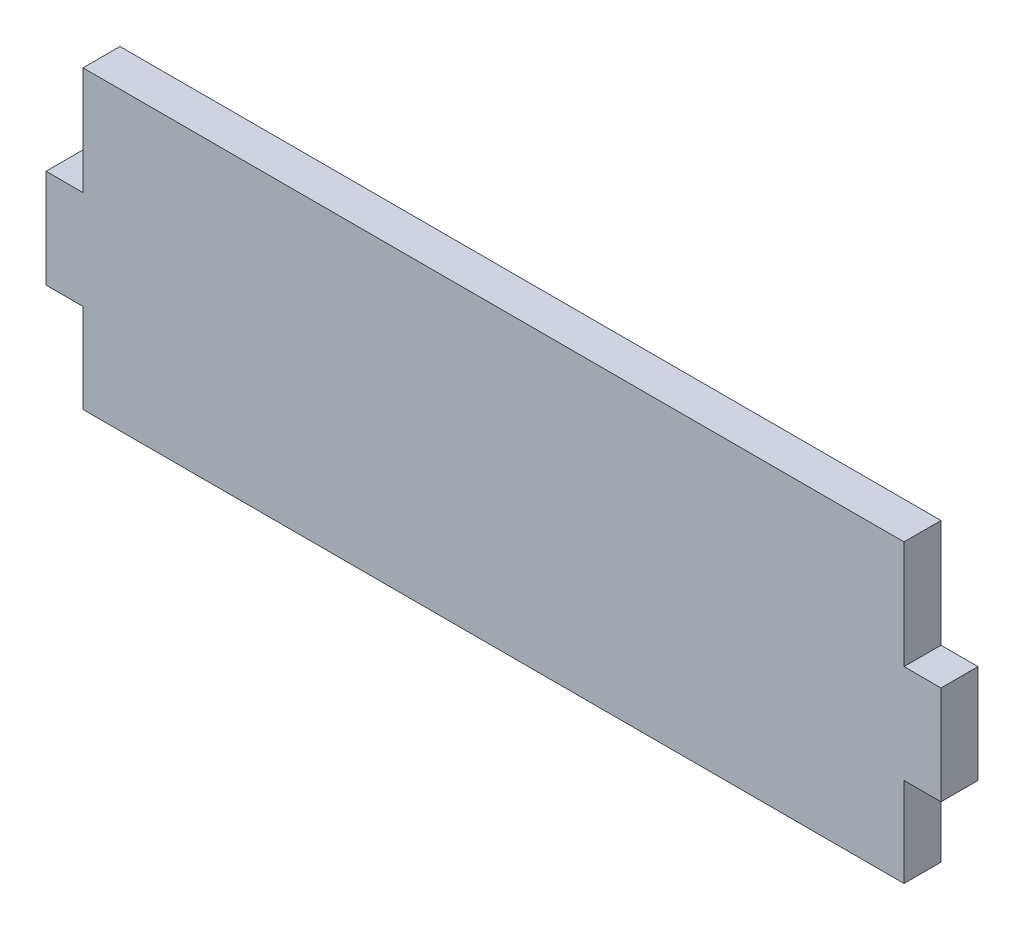
ISO-10303-21;
HEADER;
FILE_DESCRIPTION(('STEP AP214'),'2;1');
FILE_NAME('part.step','',(''),(''),'','','');
FILE_SCHEMA(('AUTOMOTIVE_DESIGN { 1 0 10303 214 1 1 1 1 }'));
ENDSEC;
DATA;
#1=APPLICATION_CONTEXT('core data for automotive mechanical design processes');
#2=APPLICATION_PROTOCOL_DEFINITION('international standard','automotive_design',2000,#1);
#3=PRODUCT_CONTEXT('',#1,'mechanical');
#4=PRODUCT('Part','Part','',(#3));
#5=PRODUCT_RELATED_PRODUCT_CATEGORY('part','',(#4));
#6=PRODUCT_DEFINITION_FORMATION('','',#4);
#7=PRODUCT_DEFINITION_CONTEXT('part definition',#1,'design');
#8=PRODUCT_DEFINITION('design','',#6,#7);
#9=PRODUCT_DEFINITION_SHAPE('','',#8);
#10=(LENGTH_UNIT() NAMED_UNIT(*) SI_UNIT(.MILLI.,.METRE.));
#11=(NAMED_UNIT(*) PLANE_ANGLE_UNIT() SI_UNIT($,.RADIAN.));
#12=(NAMED_UNIT(*) SI_UNIT($,.STERADIAN.) SOLID_ANGLE_UNIT());
#13=UNCERTAINTY_MEASURE_WITH_UNIT(LENGTH_MEASURE(1.E-05),#10,'distance_accuracy_value','');
#14=(GEOMETRIC_REPRESENTATION_CONTEXT(3) GLOBAL_UNCERTAINTY_ASSIGNED_CONTEXT((#13)) GLOBAL_UNIT_ASSIGNED_CONTEXT((#10,
#11,#12)) REPRESENTATION_CONTEXT('',''));
#15=CARTESIAN_POINT('',(0.,0.,0.));
#16=DIRECTION('',(0.,0.,1.));
#17=DIRECTION('',(1.,0.,0.));
#18=AXIS2_PLACEMENT_3D('',#15,#16,#17);
#19=CARTESIAN_POINT('',(0.,0.,5.));
#20=DIRECTION('',(1.,0.,0.));
#21=DIRECTION('',(0.,0.,-1.));
#22=AXIS2_PLACEMENT_3D('',#19,#20,#21);
#23=PLANE('',#22);
#24=DIRECTION('',(0.,0.,1.));
#25=VECTOR('',#24,1.);
#26=CARTESIAN_POINT('',(0.,12.0633333,5.));
#27=LINE('',#26,#25);
#28=CARTESIAN_POINT('',(0.,12.0633333,0.));
#29=VERTEX_POINT('',#28);
#30=CARTESIAN_POINT('',(0.,12.0633333,5.));
#31=VERTEX_POINT('',#30);
#32=EDGE_CURVE('E152',#29,#31,#27,.T.);
#33=ORIENTED_EDGE('',*,*,#32,.F.);
#34=DIRECTION('',(0.,-1.,0.));
#35=VECTOR('',#34,1.);
#36=CARTESIAN_POINT('',(0.,0.,0.));
#37=LINE('',#36,#35);
#38=CARTESIAN_POINT('',(0.,0.,0.));
#39=VERTEX_POINT('',#38);
#40=EDGE_CURVE('E200',#29,#39,#37,.T.);
#41=ORIENTED_EDGE('',*,*,#40,.T.);
#42=DIRECTION('',(0.,0.,-1.));
#43=VECTOR('',#42,1.);
#44=CARTESIAN_POINT('',(0.,0.,5.));
#45=LINE('',#44,#43);
#46=CARTESIAN_POINT('',(0.,0.,5.));
#47=VERTEX_POINT('',#46);
#48=EDGE_CURVE('E11',#47,#39,#45,.T.);
#49=ORIENTED_EDGE('',*,*,#48,.F.);
#50=DIRECTION('',(0.,-1.,0.));
#51=VECTOR('',#50,1.);
#52=CARTESIAN_POINT('',(0.,0.,5.));
#53=LINE('',#52,#51);
#54=EDGE_CURVE('E56',#31,#47,#53,.T.);
#55=ORIENTED_EDGE('',*,*,#54,.F.);
#56=EDGE_LOOP('',(#33,#41,#49,#55));
#57=FACE_BOUND('',#56,.T.);
#58=ADVANCED_FACE('F41',(#57),#23,.F.);
#59=DIRECTION('',(0.,0.,-1.));
#60=VECTOR('',#59,1.);
#61=CARTESIAN_POINT('',(0.,25.3966666333333,5.));
#62=LINE('',#61,#60);
#63=CARTESIAN_POINT('',(0.,25.3966666333333,5.));
#64=VERTEX_POINT('',#63);
#65=CARTESIAN_POINT('',(0.,25.3966666333333,0.));
#66=VERTEX_POINT('',#65);
#67=EDGE_CURVE('E64',#64,#66,#62,.T.);
#68=ORIENTED_EDGE('',*,*,#67,.F.);
#69=CARTESIAN_POINT('',(0.,40.,5.));
#70=VERTEX_POINT('',#69);
#71=EDGE_CURVE('E155',#70,#64,#53,.T.);
#72=ORIENTED_EDGE('',*,*,#71,.F.);
#73=DIRECTION('',(0.,0.,-1.));
#74=VECTOR('',#73,1.);
#75=CARTESIAN_POINT('',(0.,40.,5.));
#76=LINE('',#75,#74);
#77=CARTESIAN_POINT('',(0.,40.,0.));
#78=VERTEX_POINT('',#77);
#79=EDGE_CURVE('E214',#70,#78,#76,.T.);
#80=ORIENTED_EDGE('',*,*,#79,.T.);
#81=EDGE_CURVE('E215',#78,#66,#37,.T.);
#82=ORIENTED_EDGE('',*,*,#81,.T.);
#83=EDGE_LOOP('',(#68,#72,#80,#82));
#84=FACE_BOUND('',#83,.T.);
#85=ADVANCED_FACE('F272',(#84),#23,.F.);
#86=CARTESIAN_POINT('',(111.,0.,5.));
#87=DIRECTION('',(-1.,0.,0.));
#88=DIRECTION('',(0.,0.,1.));
#89=AXIS2_PLACEMENT_3D('',#86,#87,#88);
#90=PLANE('',#89);
#91=DIRECTION('',(0.,0.,1.));
#92=VECTOR('',#91,1.);
#93=CARTESIAN_POINT('',(111.,25.3966666333333,5.));
#94=LINE('',#93,#92);
#95=CARTESIAN_POINT('',(111.,25.3966666333333,0.));
#96=VERTEX_POINT('',#95);
#97=CARTESIAN_POINT('',(111.,25.3966666333333,5.));
#98=VERTEX_POINT('',#97);
#99=EDGE_CURVE('E162',#96,#98,#94,.T.);
#100=ORIENTED_EDGE('',*,*,#99,.F.);
#101=DIRECTION('',(0.,1.,0.));
#102=VECTOR('',#101,1.);
#103=CARTESIAN_POINT('',(111.,0.,0.));
#104=LINE('',#103,#102);
#105=CARTESIAN_POINT('',(111.,40.,0.));
#106=VERTEX_POINT('',#105);
#107=EDGE_CURVE('E221',#96,#106,#104,.T.);
#108=ORIENTED_EDGE('',*,*,#107,.T.);
#109=DIRECTION('',(0.,0.,-1.));
#110=VECTOR('',#109,1.);
#111=CARTESIAN_POINT('',(111.,40.,5.));
#112=LINE('',#111,#110);
#113=CARTESIAN_POINT('',(111.,40.,5.));
#114=VERTEX_POINT('',#113);
#115=EDGE_CURVE('E231',#114,#106,#112,.T.);
#116=ORIENTED_EDGE('',*,*,#115,.F.);
#117=DIRECTION('',(0.,1.,0.));
#118=VECTOR('',#117,1.);
#119=CARTESIAN_POINT('',(111.,0.,5.));
#120=LINE('',#119,#118);
#121=EDGE_CURVE('E206',#98,#114,#120,.T.);
#122=ORIENTED_EDGE('',*,*,#121,.F.);
#123=EDGE_LOOP('',(#100,#108,#116,#122));
#124=FACE_BOUND('',#123,.T.);
#125=ADVANCED_FACE('F267',(#124),#90,.F.);
#126=DIRECTION('',(0.,0.,-1.));
#127=VECTOR('',#126,1.);
#128=CARTESIAN_POINT('',(111.,12.0633333,5.));
#129=LINE('',#128,#127);
#130=CARTESIAN_POINT('',(111.,12.0633333,5.));
#131=VERTEX_POINT('',#130);
#132=CARTESIAN_POINT('',(111.,12.0633333,0.));
#133=VERTEX_POINT('',#132);
#134=EDGE_CURVE('E157',#131,#133,#129,.T.);
#135=ORIENTED_EDGE('',*,*,#134,.F.);
#136=CARTESIAN_POINT('',(111.,0.,5.));
#137=VERTEX_POINT('',#136);
#138=EDGE_CURVE('E207',#137,#131,#120,.T.);
#139=ORIENTED_EDGE('',*,*,#138,.F.);
#140=DIRECTION('',(0.,0.,-1.));
#141=VECTOR('',#140,1.);
#142=CARTESIAN_POINT('',(111.,0.,5.));
#143=LINE('',#142,#141);
#144=CARTESIAN_POINT('',(111.,0.,0.));
#145=VERTEX_POINT('',#144);
#146=EDGE_CURVE('E49',#137,#145,#143,.T.);
#147=ORIENTED_EDGE('',*,*,#146,.T.);
#148=EDGE_CURVE('E222',#145,#133,#104,.T.);
#149=ORIENTED_EDGE('',*,*,#148,.T.);
#150=EDGE_LOOP('',(#135,#139,#147,#149));
#151=FACE_BOUND('',#150,.T.);
#152=ADVANCED_FACE('F240',(#151),#90,.F.);
#153=CARTESIAN_POINT('',(0.,0.,5.));
#154=DIRECTION('',(0.,1.,0.));
#155=DIRECTION('',(0.,0.,1.));
#156=AXIS2_PLACEMENT_3D('',#153,#154,#155);
#157=PLANE('',#156);
#158=DIRECTION('',(1.,0.,0.));
#159=VECTOR('',#158,1.);
#160=CARTESIAN_POINT('',(0.,0.,0.));
#161=LINE('',#160,#159);
#162=EDGE_CURVE('E218',#39,#145,#161,.T.);
#163=ORIENTED_EDGE('',*,*,#162,.T.);
#164=ORIENTED_EDGE('',*,*,#146,.F.);
#165=DIRECTION('',(1.,0.,0.));
#166=VECTOR('',#165,1.);
#167=CARTESIAN_POINT('',(0.,0.,5.));
#168=LINE('',#167,#166);
#169=EDGE_CURVE('E203',#47,#137,#168,.T.);
#170=ORIENTED_EDGE('',*,*,#169,.F.);
#171=ORIENTED_EDGE('',*,*,#48,.T.);
#172=EDGE_LOOP('',(#163,#164,#170,#171));
#173=FACE_BOUND('',#172,.T.);
#174=ADVANCED_FACE('F255',(#173),#157,.F.);
#175=CARTESIAN_POINT('',(0.,40.,5.));
#176=DIRECTION('',(0.,-1.,0.));
#177=DIRECTION('',(0.,0.,-1.));
#178=AXIS2_PLACEMENT_3D('',#175,#176,#177);
#179=PLANE('',#178);
#180=DIRECTION('',(-1.,0.,0.));
#181=VECTOR('',#180,1.);
#182=CARTESIAN_POINT('',(0.,40.,0.));
#183=LINE('',#182,#181);
#184=EDGE_CURVE('E225',#106,#78,#183,.T.);
#185=ORIENTED_EDGE('',*,*,#184,.T.);
#186=ORIENTED_EDGE('',*,*,#79,.F.);
#187=DIRECTION('',(-1.,0.,0.));
#188=VECTOR('',#187,1.);
#189=CARTESIAN_POINT('',(0.,40.,5.));
#190=LINE('',#189,#188);
#191=EDGE_CURVE('E211',#114,#70,#190,.T.);
#192=ORIENTED_EDGE('',*,*,#191,.F.);
#193=ORIENTED_EDGE('',*,*,#115,.T.);
#194=EDGE_LOOP('',(#185,#186,#192,#193));
#195=FACE_BOUND('',#194,.T.);
#196=ADVANCED_FACE('F271',(#195),#179,.F.);
#197=CARTESIAN_POINT('',(0.,0.,5.));
#198=DIRECTION('',(0.,0.,-1.));
#199=DIRECTION('',(-1.,0.,0.));
#200=AXIS2_PLACEMENT_3D('',#197,#198,#199);
#201=PLANE('',#200);
#202=ORIENTED_EDGE('',*,*,#71,.T.);
#203=DIRECTION('',(1.,0.,0.));
#204=VECTOR('',#203,1.);
#205=CARTESIAN_POINT('',(-5.,25.3966666333333,5.));
#206=LINE('',#205,#204);
#207=CARTESIAN_POINT('',(-5.,25.3966666333333,5.));
#208=VERTEX_POINT('',#207);
#209=EDGE_CURVE('E135',#208,#64,#206,.T.);
#210=ORIENTED_EDGE('',*,*,#209,.F.);
#211=DIRECTION('',(0.,1.,0.));
#212=VECTOR('',#211,1.);
#213=CARTESIAN_POINT('',(-5.,25.3966666333333,5.));
#214=LINE('',#213,#212);
#215=CARTESIAN_POINT('',(-5.,12.0633333,5.));
#216=VERTEX_POINT('',#215);
#217=EDGE_CURVE('E142',#216,#208,#214,.T.);
#218=ORIENTED_EDGE('',*,*,#217,.F.);
#219=DIRECTION('',(1.,0.,0.));
#220=VECTOR('',#219,1.);
#221=CARTESIAN_POINT('',(-5.,12.0633333,5.));
#222=LINE('',#221,#220);
#223=EDGE_CURVE('E399',#216,#31,#222,.T.);
#224=ORIENTED_EDGE('',*,*,#223,.T.);
#225=ORIENTED_EDGE('',*,*,#54,.T.);
#226=ORIENTED_EDGE('',*,*,#169,.T.);
#227=ORIENTED_EDGE('',*,*,#138,.T.);
#228=DIRECTION('',(-1.,0.,0.));
#229=VECTOR('',#228,1.);
#230=CARTESIAN_POINT('',(116.,12.0633333,5.));
#231=LINE('',#230,#229);
#232=CARTESIAN_POINT('',(116.,12.0633333,5.));
#233=VERTEX_POINT('',#232);
#234=EDGE_CURVE('E196',#233,#131,#231,.T.);
#235=ORIENTED_EDGE('',*,*,#234,.F.);
#236=DIRECTION('',(0.,-1.,0.));
#237=VECTOR('',#236,1.);
#238=CARTESIAN_POINT('',(116.,12.0633333,5.));
#239=LINE('',#238,#237);
#240=CARTESIAN_POINT('',(116.,25.3966666333333,5.));
#241=VERTEX_POINT('',#240);
#242=EDGE_CURVE('E168',#241,#233,#239,.T.);
#243=ORIENTED_EDGE('',*,*,#242,.F.);
#244=DIRECTION('',(-1.,0.,0.));
#245=VECTOR('',#244,1.);
#246=CARTESIAN_POINT('',(116.,25.3966666333333,5.));
#247=LINE('',#246,#245);
#248=EDGE_CURVE('E180',#241,#98,#247,.T.);
#249=ORIENTED_EDGE('',*,*,#248,.T.);
#250=ORIENTED_EDGE('',*,*,#121,.T.);
#251=ORIENTED_EDGE('',*,*,#191,.T.);
#252=EDGE_LOOP('',(#202,#210,#218,#224,#225,#226,#227,#235,#243,#249,#250,#251));
#253=FACE_BOUND('',#252,.T.);
#254=ADVANCED_FACE('F154',(#253),#201,.F.);
#255=CARTESIAN_POINT('',(0.,0.,0.));
#256=DIRECTION('',(0.,0.,-1.));
#257=DIRECTION('',(-1.,0.,0.));
#258=AXIS2_PLACEMENT_3D('',#255,#256,#257);
#259=PLANE('',#258);
#260=ORIENTED_EDGE('',*,*,#81,.F.);
#261=ORIENTED_EDGE('',*,*,#184,.F.);
#262=ORIENTED_EDGE('',*,*,#107,.F.);
#263=DIRECTION('',(-1.,0.,0.));
#264=VECTOR('',#263,1.);
#265=CARTESIAN_POINT('',(116.,25.3966666333333,0.));
#266=LINE('',#265,#264);
#267=CARTESIAN_POINT('',(116.,25.3966666333333,0.));
#268=VERTEX_POINT('',#267);
#269=EDGE_CURVE('E188',#268,#96,#266,.T.);
#270=ORIENTED_EDGE('',*,*,#269,.F.);
#271=DIRECTION('',(0.,1.,0.));
#272=VECTOR('',#271,1.);
#273=CARTESIAN_POINT('',(116.,12.0633333,0.));
#274=LINE('',#273,#272);
#275=CARTESIAN_POINT('',(116.,12.0633333,0.));
#276=VERTEX_POINT('',#275);
#277=EDGE_CURVE('E175',#276,#268,#274,.T.);
#278=ORIENTED_EDGE('',*,*,#277,.F.);
#279=DIRECTION('',(-1.,0.,0.));
#280=VECTOR('',#279,1.);
#281=CARTESIAN_POINT('',(116.,12.0633333,0.));
#282=LINE('',#281,#280);
#283=EDGE_CURVE('E192',#276,#133,#282,.T.);
#284=ORIENTED_EDGE('',*,*,#283,.T.);
#285=ORIENTED_EDGE('',*,*,#148,.F.);
#286=ORIENTED_EDGE('',*,*,#162,.F.);
#287=ORIENTED_EDGE('',*,*,#40,.F.);
#288=DIRECTION('',(1.,0.,0.));
#289=VECTOR('',#288,1.);
#290=CARTESIAN_POINT('',(-5.,12.0633333,0.));
#291=LINE('',#290,#289);
#292=CARTESIAN_POINT('',(-5.,12.0633333,0.));
#293=VERTEX_POINT('',#292);
#294=EDGE_CURVE('E164',#293,#29,#291,.T.);
#295=ORIENTED_EDGE('',*,*,#294,.F.);
#296=DIRECTION('',(0.,-1.,0.));
#297=VECTOR('',#296,1.);
#298=CARTESIAN_POINT('',(-5.,25.3966666333333,0.));
#299=LINE('',#298,#297);
#300=CARTESIAN_POINT('',(-5.,25.3966666333333,0.));
#301=VERTEX_POINT('',#300);
#302=EDGE_CURVE('E141',#301,#293,#299,.T.);
#303=ORIENTED_EDGE('',*,*,#302,.F.);
#304=DIRECTION('',(1.,0.,0.));
#305=VECTOR('',#304,1.);
#306=CARTESIAN_POINT('',(-5.,25.3966666333333,0.));
#307=LINE('',#306,#305);
#308=EDGE_CURVE('E137',#301,#66,#307,.T.);
#309=ORIENTED_EDGE('',*,*,#308,.T.);
#310=EDGE_LOOP('',(#260,#261,#262,#270,#278,#284,#285,#286,#287,#295,#303,#309));
#311=FACE_BOUND('',#310,.T.);
#312=ADVANCED_FACE('F246',(#311),#259,.T.);
#313=CARTESIAN_POINT('',(116.,12.0633333,5.));
#314=DIRECTION('',(0.,1.,0.));
#315=DIRECTION('',(0.,0.,1.));
#316=AXIS2_PLACEMENT_3D('',#313,#314,#315);
#317=PLANE('',#316);
#318=ORIENTED_EDGE('',*,*,#134,.T.);
#319=ORIENTED_EDGE('',*,*,#283,.F.);
#320=DIRECTION('',(0.,0.,-1.));
#321=VECTOR('',#320,1.);
#322=CARTESIAN_POINT('',(116.,12.0633333,5.));
#323=LINE('',#322,#321);
#324=EDGE_CURVE('E172',#233,#276,#323,.T.);
#325=ORIENTED_EDGE('',*,*,#324,.F.);
#326=ORIENTED_EDGE('',*,*,#234,.T.);
#327=EDGE_LOOP('',(#318,#319,#325,#326));
#328=FACE_BOUND('',#327,.T.);
#329=ADVANCED_FACE('F252',(#328),#317,.F.);
#330=CARTESIAN_POINT('',(116.,25.3966666333333,5.));
#331=DIRECTION('',(0.,-1.,0.));
#332=DIRECTION('',(0.,0.,-1.));
#333=AXIS2_PLACEMENT_3D('',#330,#331,#332);
#334=PLANE('',#333);
#335=ORIENTED_EDGE('',*,*,#99,.T.);
#336=ORIENTED_EDGE('',*,*,#248,.F.);
#337=DIRECTION('',(0.,0.,1.));
#338=VECTOR('',#337,1.);
#339=CARTESIAN_POINT('',(116.,25.3966666333333,5.));
#340=LINE('',#339,#338);
#341=EDGE_CURVE('E178',#268,#241,#340,.T.);
#342=ORIENTED_EDGE('',*,*,#341,.F.);
#343=ORIENTED_EDGE('',*,*,#269,.T.);
#344=EDGE_LOOP('',(#335,#336,#342,#343));
#345=FACE_BOUND('',#344,.T.);
#346=ADVANCED_FACE('F292',(#345),#334,.F.);
#347=CARTESIAN_POINT('',(116.,0.,0.));
#348=DIRECTION('',(-1.,0.,0.));
#349=DIRECTION('',(0.,0.,1.));
#350=AXIS2_PLACEMENT_3D('',#347,#348,#349);
#351=PLANE('',#350);
#352=ORIENTED_EDGE('',*,*,#242,.T.);
#353=ORIENTED_EDGE('',*,*,#324,.T.);
#354=ORIENTED_EDGE('',*,*,#277,.T.);
#355=ORIENTED_EDGE('',*,*,#341,.T.);
#356=EDGE_LOOP('',(#352,#353,#354,#355));
#357=FACE_BOUND('',#356,.T.);
#358=ADVANCED_FACE('F287',(#357),#351,.F.);
#359=CARTESIAN_POINT('',(-5.,25.3966666333333,5.));
#360=DIRECTION('',(0.,-1.,0.));
#361=DIRECTION('',(0.,0.,-1.));
#362=AXIS2_PLACEMENT_3D('',#359,#360,#361);
#363=PLANE('',#362);
#364=ORIENTED_EDGE('',*,*,#67,.T.);
#365=ORIENTED_EDGE('',*,*,#308,.F.);
#366=DIRECTION('',(0.,0.,-1.));
#367=VECTOR('',#366,1.);
#368=CARTESIAN_POINT('',(-5.,25.3966666333333,5.));
#369=LINE('',#368,#367);
#370=EDGE_CURVE('E131',#208,#301,#369,.T.);
#371=ORIENTED_EDGE('',*,*,#370,.F.);
#372=ORIENTED_EDGE('',*,*,#209,.T.);
#373=EDGE_LOOP('',(#364,#365,#371,#372));
#374=FACE_BOUND('',#373,.T.);
#375=ADVANCED_FACE('F133',(#374),#363,.F.);
#376=CARTESIAN_POINT('',(-5.,12.0633333,5.));
#377=DIRECTION('',(0.,1.,0.));
#378=DIRECTION('',(0.,0.,1.));
#379=AXIS2_PLACEMENT_3D('',#376,#377,#378);
#380=PLANE('',#379);
#381=ORIENTED_EDGE('',*,*,#32,.T.);
#382=ORIENTED_EDGE('',*,*,#223,.F.);
#383=DIRECTION('',(0.,0.,1.));
#384=VECTOR('',#383,1.);
#385=CARTESIAN_POINT('',(-5.,12.0633333,5.));
#386=LINE('',#385,#384);
#387=EDGE_CURVE('E147',#293,#216,#386,.T.);
#388=ORIENTED_EDGE('',*,*,#387,.F.);
#389=ORIENTED_EDGE('',*,*,#294,.T.);
#390=EDGE_LOOP('',(#381,#382,#388,#389));
#391=FACE_BOUND('',#390,.T.);
#392=ADVANCED_FACE('F351',(#391),#380,.F.);
#393=CARTESIAN_POINT('',(-5.,0.,0.));
#394=DIRECTION('',(1.,0.,0.));
#395=DIRECTION('',(0.,0.,-1.));
#396=AXIS2_PLACEMENT_3D('',#393,#394,#395);
#397=PLANE('',#396);
#398=ORIENTED_EDGE('',*,*,#217,.T.);
#399=ORIENTED_EDGE('',*,*,#370,.T.);
#400=ORIENTED_EDGE('',*,*,#302,.T.);
#401=ORIENTED_EDGE('',*,*,#387,.T.);
#402=EDGE_LOOP('',(#398,#399,#400,#401));
#403=FACE_BOUND('',#402,.T.);
#404=ADVANCED_FACE('F145',(#403),#397,.F.);
#405=CLOSED_SHELL('',(#58,#85,#125,#152,#174,#196,#254,#312,#329,#346,#358,#375,#392,#404));
#406=MANIFOLD_SOLID_BREP('B2',#405);
#407=ADVANCED_BREP_SHAPE_REPRESENTATION('',(#18,#406),#14);
#408=SHAPE_DEFINITION_REPRESENTATION(#9,#407);
ENDSEC;
END-ISO-10303-21;
